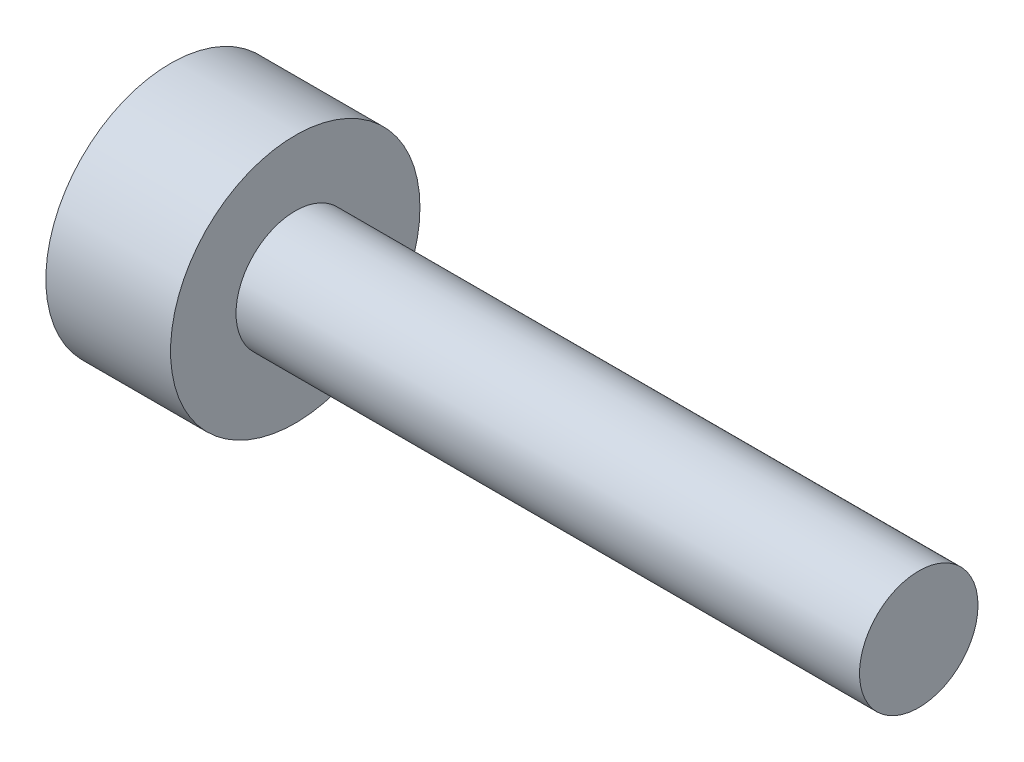
ISO-10303-21;
HEADER;
FILE_DESCRIPTION(('STEP AP214'),'2;1');
FILE_NAME('part.step','',(''),(''),'','','');
FILE_SCHEMA(('AUTOMOTIVE_DESIGN { 1 0 10303 214 1 1 1 1 }'));
ENDSEC;
DATA;
#1=APPLICATION_CONTEXT('core data for automotive mechanical design processes');
#2=APPLICATION_PROTOCOL_DEFINITION('international standard','automotive_design',2000,#1);
#3=PRODUCT_CONTEXT('',#1,'mechanical');
#4=PRODUCT('Part','Part','',(#3));
#5=PRODUCT_RELATED_PRODUCT_CATEGORY('part','',(#4));
#6=PRODUCT_DEFINITION_FORMATION('','',#4);
#7=PRODUCT_DEFINITION_CONTEXT('part definition',#1,'design');
#8=PRODUCT_DEFINITION('design','',#6,#7);
#9=PRODUCT_DEFINITION_SHAPE('','',#8);
#10=(LENGTH_UNIT() NAMED_UNIT(*) SI_UNIT(.MILLI.,.METRE.));
#11=(NAMED_UNIT(*) PLANE_ANGLE_UNIT() SI_UNIT($,.RADIAN.));
#12=(NAMED_UNIT(*) SI_UNIT($,.STERADIAN.) SOLID_ANGLE_UNIT());
#13=UNCERTAINTY_MEASURE_WITH_UNIT(LENGTH_MEASURE(1.E-05),#10,'distance_accuracy_value','');
#14=(GEOMETRIC_REPRESENTATION_CONTEXT(3) GLOBAL_UNCERTAINTY_ASSIGNED_CONTEXT((#13)) GLOBAL_UNIT_ASSIGNED_CONTEXT((#10,
#11,#12)) REPRESENTATION_CONTEXT('',''));
#15=CARTESIAN_POINT('',(0.,0.,0.));
#16=DIRECTION('',(0.,0.,1.));
#17=DIRECTION('',(1.,0.,0.));
#18=AXIS2_PLACEMENT_3D('',#15,#16,#17);
#19=CARTESIAN_POINT('',(10.,0.,0.));
#20=DIRECTION('',(-1.,0.,0.));
#21=DIRECTION('',(0.,0.,1.));
#22=AXIS2_PLACEMENT_3D('',#19,#20,#21);
#23=CYLINDRICAL_SURFACE('',#22,10.);
#24=CARTESIAN_POINT('',(10.,0.,0.));
#25=DIRECTION('',(1.,0.,0.));
#26=DIRECTION('',(0.,0.,-1.));
#27=AXIS2_PLACEMENT_3D('',#24,#25,#26);
#28=CIRCLE('',#27,10.);
#29=CARTESIAN_POINT('',(10.,0.,-10.));
#30=VERTEX_POINT('',#29);
#31=EDGE_CURVE('E10',#30,#30,#28,.T.);
#32=ORIENTED_EDGE('',*,*,#31,.F.);
#33=EDGE_LOOP('',(#32));
#34=FACE_BOUND('',#33,.T.);
#35=CARTESIAN_POINT('',(0.,0.,0.));
#36=DIRECTION('',(1.,0.,0.));
#37=DIRECTION('',(0.,0.,-1.));
#38=AXIS2_PLACEMENT_3D('',#35,#36,#37);
#39=CIRCLE('',#38,10.);
#40=CARTESIAN_POINT('',(0.,0.,-10.));
#41=VERTEX_POINT('',#40);
#42=EDGE_CURVE('E34',#41,#41,#39,.T.);
#43=ORIENTED_EDGE('',*,*,#42,.T.);
#44=EDGE_LOOP('',(#43));
#45=FACE_BOUND('',#44,.T.);
#46=ADVANCED_FACE('F31',(#34,#45),#23,.T.);
#47=CARTESIAN_POINT('',(10.,0.,0.));
#48=DIRECTION('',(1.,0.,0.));
#49=DIRECTION('',(0.,0.,-1.));
#50=AXIS2_PLACEMENT_3D('',#47,#48,#49);
#51=PLANE('',#50);
#52=CARTESIAN_POINT('',(10.,0.,0.));
#53=DIRECTION('',(1.,0.,0.));
#54=DIRECTION('',(0.,0.,-1.));
#55=AXIS2_PLACEMENT_3D('',#52,#53,#54);
#56=CIRCLE('',#55,4.75);
#57=CARTESIAN_POINT('',(10.,0.,-4.75));
#58=VERTEX_POINT('',#57);
#59=EDGE_CURVE('E43',#58,#58,#56,.T.);
#60=ORIENTED_EDGE('',*,*,#59,.F.);
#61=EDGE_LOOP('',(#60));
#62=FACE_BOUND('',#61,.T.);
#63=ORIENTED_EDGE('',*,*,#31,.T.);
#64=EDGE_LOOP('',(#63));
#65=FACE_BOUND('',#64,.T.);
#66=ADVANCED_FACE('F58',(#62,#65),#51,.T.);
#67=CARTESIAN_POINT('',(0.,0.,0.));
#68=DIRECTION('',(1.,0.,0.));
#69=DIRECTION('',(0.,0.,-1.));
#70=AXIS2_PLACEMENT_3D('',#67,#68,#69);
#71=PLANE('',#70);
#72=ORIENTED_EDGE('',*,*,#42,.F.);
#73=EDGE_LOOP('',(#72));
#74=FACE_BOUND('',#73,.T.);
#75=ADVANCED_FACE('F54',(#74),#71,.F.);
#76=CARTESIAN_POINT('',(60.,0.,0.));
#77=DIRECTION('',(-1.,0.,0.));
#78=DIRECTION('',(0.,0.,1.));
#79=AXIS2_PLACEMENT_3D('',#76,#77,#78);
#80=CYLINDRICAL_SURFACE('',#79,4.75);
#81=CARTESIAN_POINT('',(60.,0.,0.));
#82=DIRECTION('',(1.,0.,0.));
#83=DIRECTION('',(0.,0.,-1.));
#84=AXIS2_PLACEMENT_3D('',#81,#82,#83);
#85=CIRCLE('',#84,4.75);
#86=CARTESIAN_POINT('',(60.,0.,-4.75));
#87=VERTEX_POINT('',#86);
#88=EDGE_CURVE('E41',#87,#87,#85,.T.);
#89=ORIENTED_EDGE('',*,*,#88,.F.);
#90=EDGE_LOOP('',(#89));
#91=FACE_BOUND('',#90,.T.);
#92=ORIENTED_EDGE('',*,*,#59,.T.);
#93=EDGE_LOOP('',(#92));
#94=FACE_BOUND('',#93,.T.);
#95=ADVANCED_FACE('F51',(#91,#94),#80,.T.);
#96=CARTESIAN_POINT('',(60.,0.,0.));
#97=DIRECTION('',(1.,0.,0.));
#98=DIRECTION('',(0.,0.,-1.));
#99=AXIS2_PLACEMENT_3D('',#96,#97,#98);
#100=PLANE('',#99);
#101=ORIENTED_EDGE('',*,*,#88,.T.);
#102=EDGE_LOOP('',(#101));
#103=FACE_BOUND('',#102,.T.);
#104=ADVANCED_FACE('F49',(#103),#100,.T.);
#105=CLOSED_SHELL('',(#46,#66,#75,#95,#104));
#106=MANIFOLD_SOLID_BREP('B2',#105);
#107=ADVANCED_BREP_SHAPE_REPRESENTATION('',(#18,#106),#14);
#108=SHAPE_DEFINITION_REPRESENTATION(#9,#107);
ENDSEC;
END-ISO-10303-21;
